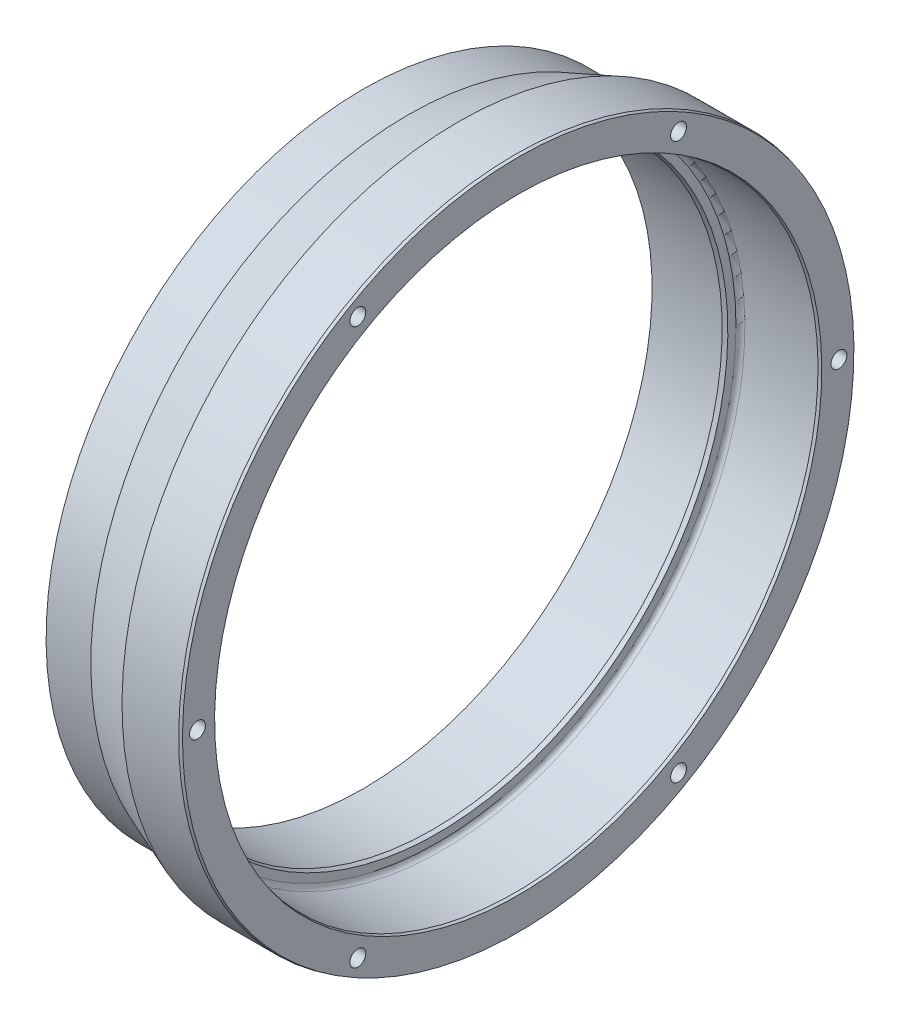
ISO-10303-21;
HEADER;
FILE_DESCRIPTION(('STEP AP214'),'2;1');
FILE_NAME('part.step','',(''),(''),'','','');
FILE_SCHEMA(('AUTOMOTIVE_DESIGN { 1 0 10303 214 1 1 1 1 }'));
ENDSEC;
DATA;
#1=APPLICATION_CONTEXT('core data for automotive mechanical design processes');
#2=APPLICATION_PROTOCOL_DEFINITION('international standard','automotive_design',2000,#1);
#3=PRODUCT_CONTEXT('',#1,'mechanical');
#4=PRODUCT('Part','Part','',(#3));
#5=PRODUCT_RELATED_PRODUCT_CATEGORY('part','',(#4));
#6=PRODUCT_DEFINITION_FORMATION('','',#4);
#7=PRODUCT_DEFINITION_CONTEXT('part definition',#1,'design');
#8=PRODUCT_DEFINITION('design','',#6,#7);
#9=PRODUCT_DEFINITION_SHAPE('','',#8);
#10=(LENGTH_UNIT() NAMED_UNIT(*) SI_UNIT(.MILLI.,.METRE.));
#11=(NAMED_UNIT(*) PLANE_ANGLE_UNIT() SI_UNIT($,.RADIAN.));
#12=(NAMED_UNIT(*) SI_UNIT($,.STERADIAN.) SOLID_ANGLE_UNIT());
#13=UNCERTAINTY_MEASURE_WITH_UNIT(LENGTH_MEASURE(1.E-05),#10,'distance_accuracy_value','');
#14=(GEOMETRIC_REPRESENTATION_CONTEXT(3) GLOBAL_UNCERTAINTY_ASSIGNED_CONTEXT((#13)) GLOBAL_UNIT_ASSIGNED_CONTEXT((#10,
#11,#12)) REPRESENTATION_CONTEXT('',''));
#15=CARTESIAN_POINT('',(0.,0.,0.));
#16=DIRECTION('',(0.,0.,1.));
#17=DIRECTION('',(1.,0.,0.));
#18=AXIS2_PLACEMENT_3D('',#15,#16,#17);
#19=CARTESIAN_POINT('',(0.,0.,0.));
#20=DIRECTION('',(1.,0.,0.));
#21=DIRECTION('',(0.,1.,0.));
#22=AXIS2_PLACEMENT_3D('',#19,#20,#21);
#23=CYLINDRICAL_SURFACE('',#22,57.3024);
#24=CARTESIAN_POINT('',(-10.16,0.,0.));
#25=DIRECTION('',(1.,0.,0.));
#26=DIRECTION('',(0.,1.,0.));
#27=AXIS2_PLACEMENT_3D('',#24,#25,#26);
#28=CIRCLE('',#27,57.3024);
#29=CARTESIAN_POINT('',(-10.16,57.3024,0.));
#30=VERTEX_POINT('',#29);
#31=EDGE_CURVE('E11',#30,#30,#28,.T.);
#32=ORIENTED_EDGE('',*,*,#31,.T.);
#33=EDGE_LOOP('',(#32));
#34=FACE_BOUND('',#33,.T.);
#35=CARTESIAN_POINT('',(-0.507999999999993,0.,0.));
#36=DIRECTION('',(1.,0.,0.));
#37=DIRECTION('',(0.,1.,0.));
#38=AXIS2_PLACEMENT_3D('',#35,#36,#37);
#39=CIRCLE('',#38,57.3024);
#40=CARTESIAN_POINT('',(-0.508,57.3024,0.));
#41=VERTEX_POINT('',#40);
#42=EDGE_CURVE('E109',#41,#41,#39,.T.);
#43=ORIENTED_EDGE('',*,*,#42,.F.);
#44=EDGE_LOOP('',(#43));
#45=FACE_BOUND('',#44,.T.);
#46=ADVANCED_FACE('F38',(#34,#45),#23,.T.);
#47=CARTESIAN_POINT('',(-10.16,0.,0.));
#48=DIRECTION('',(1.,0.,0.));
#49=DIRECTION('',(0.,1.,0.));
#50=AXIS2_PLACEMENT_3D('',#47,#48,#49);
#51=CONICAL_SURFACE('',#50,57.3024,0.367764966754291);
#52=CARTESIAN_POINT('',(-18.796,0.,0.));
#53=DIRECTION('',(1.,0.,0.));
#54=DIRECTION('',(0.,1.,0.));
#55=AXIS2_PLACEMENT_3D('',#52,#53,#54);
#56=CIRCLE('',#55,53.975);
#57=CARTESIAN_POINT('',(-18.796,53.975,0.));
#58=VERTEX_POINT('',#57);
#59=EDGE_CURVE('E45',#58,#58,#56,.T.);
#60=ORIENTED_EDGE('',*,*,#59,.T.);
#61=EDGE_LOOP('',(#60));
#62=FACE_BOUND('',#61,.T.);
#63=ORIENTED_EDGE('',*,*,#31,.F.);
#64=EDGE_LOOP('',(#63));
#65=FACE_BOUND('',#64,.T.);
#66=ADVANCED_FACE('F141',(#62,#65),#51,.T.);
#67=CARTESIAN_POINT('',(0.,0.,0.));
#68=DIRECTION('',(1.,0.,0.));
#69=DIRECTION('',(0.,1.,0.));
#70=AXIS2_PLACEMENT_3D('',#67,#68,#69);
#71=CYLINDRICAL_SURFACE('',#70,53.975);
#72=CARTESIAN_POINT('',(-26.416,0.,0.));
#73=DIRECTION('',(1.,0.,0.));
#74=DIRECTION('',(0.,1.,0.));
#75=AXIS2_PLACEMENT_3D('',#72,#73,#74);
#76=CIRCLE('',#75,53.975);
#77=CARTESIAN_POINT('',(-26.416,53.975,0.));
#78=VERTEX_POINT('',#77);
#79=EDGE_CURVE('E136',#78,#78,#76,.T.);
#80=ORIENTED_EDGE('',*,*,#79,.T.);
#81=EDGE_LOOP('',(#80));
#82=FACE_BOUND('',#81,.T.);
#83=ORIENTED_EDGE('',*,*,#59,.F.);
#84=EDGE_LOOP('',(#83));
#85=FACE_BOUND('',#84,.T.);
#86=ADVANCED_FACE('F144',(#82,#85),#71,.T.);
#87=CARTESIAN_POINT('',(-26.416,53.975,0.));
#88=DIRECTION('',(-1.,0.,0.));
#89=DIRECTION('',(0.,-1.,0.));
#90=AXIS2_PLACEMENT_3D('',#87,#88,#89);
#91=PLANE('',#90);
#92=CARTESIAN_POINT('',(-26.416,0.,0.));
#93=DIRECTION('',(1.,0.,0.));
#94=DIRECTION('',(0.,1.,0.));
#95=AXIS2_PLACEMENT_3D('',#92,#93,#94);
#96=CIRCLE('',#95,49.2125);
#97=CARTESIAN_POINT('',(-26.416,49.2125,0.));
#98=VERTEX_POINT('',#97);
#99=EDGE_CURVE('E133',#98,#98,#96,.T.);
#100=ORIENTED_EDGE('',*,*,#99,.T.);
#101=EDGE_LOOP('',(#100));
#102=FACE_BOUND('',#101,.T.);
#103=ORIENTED_EDGE('',*,*,#79,.F.);
#104=EDGE_LOOP('',(#103));
#105=FACE_BOUND('',#104,.T.);
#106=ADVANCED_FACE('F146',(#102,#105),#91,.T.);
#107=CARTESIAN_POINT('',(0.,0.,0.));
#108=DIRECTION('',(1.,0.,0.));
#109=DIRECTION('',(0.,1.,0.));
#110=AXIS2_PLACEMENT_3D('',#107,#108,#109);
#111=CYLINDRICAL_SURFACE('',#110,49.2125);
#112=CARTESIAN_POINT('',(-14.478,0.,0.));
#113=DIRECTION('',(1.,0.,0.));
#114=DIRECTION('',(0.,1.,0.));
#115=AXIS2_PLACEMENT_3D('',#112,#113,#114);
#116=CIRCLE('',#115,49.2125);
#117=CARTESIAN_POINT('',(-14.478,49.2125,0.));
#118=VERTEX_POINT('',#117);
#119=EDGE_CURVE('E130',#118,#118,#116,.T.);
#120=ORIENTED_EDGE('',*,*,#119,.T.);
#121=EDGE_LOOP('',(#120));
#122=FACE_BOUND('',#121,.T.);
#123=ORIENTED_EDGE('',*,*,#99,.F.);
#124=EDGE_LOOP('',(#123));
#125=FACE_BOUND('',#124,.T.);
#126=ADVANCED_FACE('F153',(#122,#125),#111,.F.);
#127=CARTESIAN_POINT('',(-14.478,0.,0.));
#128=DIRECTION('',(1.,0.,0.));
#129=DIRECTION('',(0.,1.,0.));
#130=AXIS2_PLACEMENT_3D('',#127,#128,#129);
#131=CONICAL_SURFACE('',#130,49.2125,0.261799387799153);
#132=CARTESIAN_POINT('',(-13.716,0.,0.));
#133=DIRECTION('',(1.,0.,0.));
#134=DIRECTION('',(0.,1.,0.));
#135=AXIS2_PLACEMENT_3D('',#132,#133,#134);
#136=CIRCLE('',#135,49.4166772846325);
#137=CARTESIAN_POINT('',(-13.716,49.4166772846325,0.));
#138=VERTEX_POINT('',#137);
#139=EDGE_CURVE('E127',#138,#138,#136,.T.);
#140=ORIENTED_EDGE('',*,*,#139,.T.);
#141=EDGE_LOOP('',(#140));
#142=FACE_BOUND('',#141,.T.);
#143=ORIENTED_EDGE('',*,*,#119,.F.);
#144=EDGE_LOOP('',(#143));
#145=FACE_BOUND('',#144,.T.);
#146=ADVANCED_FACE('F199',(#142,#145),#131,.F.);
#147=CARTESIAN_POINT('',(-13.716,49.4166772846325,0.));
#148=DIRECTION('',(1.,0.,0.));
#149=DIRECTION('',(0.,1.,0.));
#150=AXIS2_PLACEMENT_3D('',#147,#148,#149);
#151=PLANE('',#150);
#152=CARTESIAN_POINT('',(-13.716,0.,0.));
#153=DIRECTION('',(1.,0.,0.));
#154=DIRECTION('',(0.,1.,0.));
#155=AXIS2_PLACEMENT_3D('',#152,#153,#154);
#156=CIRCLE('',#155,50.8);
#157=CARTESIAN_POINT('',(-13.716,50.8,0.));
#158=VERTEX_POINT('',#157);
#159=EDGE_CURVE('E124',#158,#158,#156,.T.);
#160=ORIENTED_EDGE('',*,*,#159,.T.);
#161=EDGE_LOOP('',(#160));
#162=FACE_BOUND('',#161,.T.);
#163=ORIENTED_EDGE('',*,*,#139,.F.);
#164=EDGE_LOOP('',(#163));
#165=FACE_BOUND('',#164,.T.);
#166=ADVANCED_FACE('F193',(#162,#165),#151,.T.);
#167=CARTESIAN_POINT('',(-12.954,0.,0.));
#168=DIRECTION('',(1.,0.,0.));
#169=DIRECTION('',(0.,1.,0.));
#170=AXIS2_PLACEMENT_3D('',#167,#168,#169);
#171=TOROIDAL_SURFACE('',#170,50.8,0.762000000000002);
#172=CARTESIAN_POINT('',(-12.954,0.,0.));
#173=DIRECTION('',(1.,0.,0.));
#174=DIRECTION('',(0.,1.,0.));
#175=AXIS2_PLACEMENT_3D('',#172,#173,#174);
#176=CIRCLE('',#175,51.562);
#177=CARTESIAN_POINT('',(-12.954,51.562,0.));
#178=VERTEX_POINT('',#177);
#179=EDGE_CURVE('E121',#178,#178,#176,.T.);
#180=ORIENTED_EDGE('',*,*,#179,.T.);
#181=EDGE_LOOP('',(#180));
#182=FACE_BOUND('',#181,.T.);
#183=ORIENTED_EDGE('',*,*,#159,.F.);
#184=EDGE_LOOP('',(#183));
#185=FACE_BOUND('',#184,.T.);
#186=ADVANCED_FACE('F187',(#182,#185),#171,.F.);
#187=CARTESIAN_POINT('',(0.,0.,0.));
#188=DIRECTION('',(1.,0.,0.));
#189=DIRECTION('',(0.,1.,0.));
#190=AXIS2_PLACEMENT_3D('',#187,#188,#189);
#191=CYLINDRICAL_SURFACE('',#190,51.562);
#192=CARTESIAN_POINT('',(-0.507999999999993,0.,0.));
#193=DIRECTION('',(1.,0.,0.));
#194=DIRECTION('',(0.,1.,0.));
#195=AXIS2_PLACEMENT_3D('',#192,#193,#194);
#196=CIRCLE('',#195,51.562);
#197=CARTESIAN_POINT('',(-0.508,51.562,0.));
#198=VERTEX_POINT('',#197);
#199=EDGE_CURVE('E118',#198,#198,#196,.T.);
#200=ORIENTED_EDGE('',*,*,#199,.T.);
#201=EDGE_LOOP('',(#200));
#202=FACE_BOUND('',#201,.T.);
#203=ORIENTED_EDGE('',*,*,#179,.F.);
#204=EDGE_LOOP('',(#203));
#205=FACE_BOUND('',#204,.T.);
#206=ADVANCED_FACE('F181',(#202,#205),#191,.F.);
#207=CARTESIAN_POINT('',(-0.507999999999993,0.,0.));
#208=DIRECTION('',(1.,0.,0.));
#209=DIRECTION('',(0.,1.,0.));
#210=AXIS2_PLACEMENT_3D('',#207,#208,#209);
#211=CONICAL_SURFACE('',#210,51.562,0.261799387799145);
#212=CARTESIAN_POINT('',(0.,0.,0.));
#213=DIRECTION('',(1.,0.,0.));
#214=DIRECTION('',(0.,1.,0.));
#215=AXIS2_PLACEMENT_3D('',#212,#213,#214);
#216=CIRCLE('',#215,51.698118189755);
#217=CARTESIAN_POINT('',(0.,51.698118189755,0.));
#218=VERTEX_POINT('',#217);
#219=EDGE_CURVE('E115',#218,#218,#216,.T.);
#220=ORIENTED_EDGE('',*,*,#219,.T.);
#221=EDGE_LOOP('',(#220));
#222=FACE_BOUND('',#221,.T.);
#223=ORIENTED_EDGE('',*,*,#199,.F.);
#224=EDGE_LOOP('',(#223));
#225=FACE_BOUND('',#224,.T.);
#226=ADVANCED_FACE('F174',(#222,#225),#211,.F.);
#227=CARTESIAN_POINT('',(0.,51.698118189755,0.));
#228=DIRECTION('',(1.,0.,0.));
#229=DIRECTION('',(0.,1.,0.));
#230=AXIS2_PLACEMENT_3D('',#227,#228,#229);
#231=PLANE('',#230);
#232=CARTESIAN_POINT('',(0.,47.2936473006679,27.3050000000006));
#233=DIRECTION('',(1.,0.,0.));
#234=DIRECTION('',(0.,0.,-1.));
#235=AXIS2_PLACEMENT_3D('',#232,#233,#234);
#236=CIRCLE('',#235,1.35254999999999);
#237=CARTESIAN_POINT('',(0.,47.2936473006679,25.9524500000006));
#238=VERTEX_POINT('',#237);
#239=EDGE_CURVE('E75',#238,#238,#236,.T.);
#240=ORIENTED_EDGE('',*,*,#239,.F.);
#241=EDGE_LOOP('',(#240));
#242=FACE_BOUND('',#241,.T.);
#243=CARTESIAN_POINT('',(0.,47.2936473006684,-27.3049999999996));
#244=DIRECTION('',(1.,0.,0.));
#245=DIRECTION('',(0.,0.,-1.));
#246=AXIS2_PLACEMENT_3D('',#243,#244,#245);
#247=CIRCLE('',#246,1.35254999999999);
#248=CARTESIAN_POINT('',(0.,47.2936473006684,-28.6575499999995));
#249=VERTEX_POINT('',#248);
#250=EDGE_CURVE('E74',#249,#249,#247,.T.);
#251=ORIENTED_EDGE('',*,*,#250,.F.);
#252=EDGE_LOOP('',(#251));
#253=FACE_BOUND('',#252,.T.);
#254=CARTESIAN_POINT('',(0.,0.,-54.61));
#255=DIRECTION('',(1.,0.,0.));
#256=DIRECTION('',(0.,0.,-1.));
#257=AXIS2_PLACEMENT_3D('',#254,#255,#256);
#258=CIRCLE('',#257,1.35254999999999);
#259=CARTESIAN_POINT('',(0.,0.,-55.96255));
#260=VERTEX_POINT('',#259);
#261=EDGE_CURVE('E85',#260,#260,#258,.T.);
#262=ORIENTED_EDGE('',*,*,#261,.F.);
#263=EDGE_LOOP('',(#262));
#264=FACE_BOUND('',#263,.T.);
#265=CARTESIAN_POINT('',(0.,-47.2936473006681,-27.3050000000002));
#266=DIRECTION('',(1.,0.,0.));
#267=DIRECTION('',(0.,0.,-1.));
#268=AXIS2_PLACEMENT_3D('',#265,#266,#267);
#269=CIRCLE('',#268,1.35254999999999);
#270=CARTESIAN_POINT('',(0.,-47.2936473006681,-28.6575500000002));
#271=VERTEX_POINT('',#270);
#272=EDGE_CURVE('E91',#271,#271,#269,.T.);
#273=ORIENTED_EDGE('',*,*,#272,.F.);
#274=EDGE_LOOP('',(#273));
#275=FACE_BOUND('',#274,.T.);
#276=CARTESIAN_POINT('',(0.,-47.2936473006683,27.3049999999999));
#277=DIRECTION('',(1.,0.,0.));
#278=DIRECTION('',(0.,0.,-1.));
#279=AXIS2_PLACEMENT_3D('',#276,#277,#278);
#280=CIRCLE('',#279,1.35254999999999);
#281=CARTESIAN_POINT('',(0.,-47.2936473006683,25.9524499999999));
#282=VERTEX_POINT('',#281);
#283=EDGE_CURVE('E97',#282,#282,#280,.T.);
#284=ORIENTED_EDGE('',*,*,#283,.F.);
#285=EDGE_LOOP('',(#284));
#286=FACE_BOUND('',#285,.T.);
#287=CARTESIAN_POINT('',(0.,0.,54.61));
#288=DIRECTION('',(1.,0.,0.));
#289=DIRECTION('',(0.,0.,-1.));
#290=AXIS2_PLACEMENT_3D('',#287,#288,#289);
#291=CIRCLE('',#290,1.35254999999999);
#292=CARTESIAN_POINT('',(0.,0.,53.25745));
#293=VERTEX_POINT('',#292);
#294=EDGE_CURVE('E103',#293,#293,#291,.T.);
#295=ORIENTED_EDGE('',*,*,#294,.F.);
#296=EDGE_LOOP('',(#295));
#297=FACE_BOUND('',#296,.T.);
#298=CARTESIAN_POINT('',(0.,0.,0.));
#299=DIRECTION('',(1.,0.,0.));
#300=DIRECTION('',(0.,1.,0.));
#301=AXIS2_PLACEMENT_3D('',#298,#299,#300);
#302=CIRCLE('',#301,57.166281810245);
#303=CARTESIAN_POINT('',(0.,57.166281810245,0.));
#304=VERTEX_POINT('',#303);
#305=EDGE_CURVE('E112',#304,#304,#302,.T.);
#306=ORIENTED_EDGE('',*,*,#305,.T.);
#307=EDGE_LOOP('',(#306));
#308=FACE_BOUND('',#307,.T.);
#309=ORIENTED_EDGE('',*,*,#219,.F.);
#310=EDGE_LOOP('',(#309));
#311=FACE_BOUND('',#310,.T.);
#312=ADVANCED_FACE('F168',(#242,#253,#264,#275,#286,#297,#308,#311),#231,.T.);
#313=CARTESIAN_POINT('',(0.,0.,0.));
#314=DIRECTION('',(-1.,0.,0.));
#315=DIRECTION('',(0.,-1.,0.));
#316=AXIS2_PLACEMENT_3D('',#313,#314,#315);
#317=CONICAL_SURFACE('',#316,57.166281810245,0.261799387799145);
#318=ORIENTED_EDGE('',*,*,#42,.T.);
#319=EDGE_LOOP('',(#318));
#320=FACE_BOUND('',#319,.T.);
#321=ORIENTED_EDGE('',*,*,#305,.F.);
#322=EDGE_LOOP('',(#321));
#323=FACE_BOUND('',#322,.T.);
#324=ADVANCED_FACE('F164',(#320,#323),#317,.T.);
#325=CARTESIAN_POINT('',(-8.89,0.,54.61));
#326=DIRECTION('',(1.,0.,0.));
#327=DIRECTION('',(0.,0.,-1.));
#328=AXIS2_PLACEMENT_3D('',#325,#326,#327);
#329=CONICAL_SURFACE('',#328,1.35255,1.02974425867665);
#330=CARTESIAN_POINT('',(-9.70269403026573,0.,54.61));
#331=VERTEX_POINT('',#330);
#332=VERTEX_LOOP('',#331);
#333=FACE_BOUND('',#332,.T.);
#334=CARTESIAN_POINT('',(-8.89,0.,54.61));
#335=DIRECTION('',(1.,0.,0.));
#336=DIRECTION('',(0.,0.,-1.));
#337=AXIS2_PLACEMENT_3D('',#334,#335,#336);
#338=CIRCLE('',#337,1.35255);
#339=CARTESIAN_POINT('',(-8.89,0.,53.25745));
#340=VERTEX_POINT('',#339);
#341=EDGE_CURVE('E106',#340,#340,#338,.T.);
#342=ORIENTED_EDGE('',*,*,#341,.T.);
#343=EDGE_LOOP('',(#342));
#344=FACE_BOUND('',#343,.T.);
#345=ADVANCED_FACE('F167',(#333,#344),#329,.F.);
#346=CARTESIAN_POINT('',(0.,0.,54.61));
#347=DIRECTION('',(1.,0.,0.));
#348=DIRECTION('',(0.,0.,-1.));
#349=AXIS2_PLACEMENT_3D('',#346,#347,#348);
#350=CYLINDRICAL_SURFACE('',#349,1.35254999999999);
#351=ORIENTED_EDGE('',*,*,#341,.F.);
#352=EDGE_LOOP('',(#351));
#353=FACE_BOUND('',#352,.T.);
#354=ORIENTED_EDGE('',*,*,#294,.T.);
#355=EDGE_LOOP('',(#354));
#356=FACE_BOUND('',#355,.T.);
#357=ADVANCED_FACE('F219',(#353,#356),#350,.F.);
#358=CARTESIAN_POINT('',(-8.88999999999999,-47.2936473006683,27.3049999999999));
#359=DIRECTION('',(1.,0.,0.));
#360=DIRECTION('',(0.,0.,-1.));
#361=AXIS2_PLACEMENT_3D('',#358,#359,#360);
#362=CONICAL_SURFACE('',#361,1.35255,1.02974425867665);
#363=CARTESIAN_POINT('',(-9.70269403026572,-47.2936473006683,27.3049999999999));
#364=VERTEX_POINT('',#363);
#365=VERTEX_LOOP('',#364);
#366=FACE_BOUND('',#365,.T.);
#367=CARTESIAN_POINT('',(-8.88999999999999,-47.2936473006683,27.3049999999999));
#368=DIRECTION('',(1.,0.,0.));
#369=DIRECTION('',(0.,0.,-1.));
#370=AXIS2_PLACEMENT_3D('',#367,#368,#369);
#371=CIRCLE('',#370,1.35255);
#372=CARTESIAN_POINT('',(-8.88999999999999,-47.2936473006683,25.9524499999999));
#373=VERTEX_POINT('',#372);
#374=EDGE_CURVE('E100',#373,#373,#371,.T.);
#375=ORIENTED_EDGE('',*,*,#374,.T.);
#376=EDGE_LOOP('',(#375));
#377=FACE_BOUND('',#376,.T.);
#378=ADVANCED_FACE('F222',(#366,#377),#362,.F.);
#379=CARTESIAN_POINT('',(0.,-47.2936473006683,27.3049999999999));
#380=DIRECTION('',(1.,0.,0.));
#381=DIRECTION('',(0.,0.,-1.));
#382=AXIS2_PLACEMENT_3D('',#379,#380,#381);
#383=CYLINDRICAL_SURFACE('',#382,1.35254999999999);
#384=ORIENTED_EDGE('',*,*,#374,.F.);
#385=EDGE_LOOP('',(#384));
#386=FACE_BOUND('',#385,.T.);
#387=ORIENTED_EDGE('',*,*,#283,.T.);
#388=EDGE_LOOP('',(#387));
#389=FACE_BOUND('',#388,.T.);
#390=ADVANCED_FACE('F226',(#386,#389),#383,.F.);
#391=CARTESIAN_POINT('',(-8.88999999999999,-47.2936473006681,-27.3050000000002));
#392=DIRECTION('',(1.,0.,0.));
#393=DIRECTION('',(0.,0.,-1.));
#394=AXIS2_PLACEMENT_3D('',#391,#392,#393);
#395=CONICAL_SURFACE('',#394,1.35255,1.02974425867665);
#396=CARTESIAN_POINT('',(-9.70269403026572,-47.2936473006681,-27.3050000000002));
#397=VERTEX_POINT('',#396);
#398=VERTEX_LOOP('',#397);
#399=FACE_BOUND('',#398,.T.);
#400=CARTESIAN_POINT('',(-8.88999999999999,-47.2936473006681,-27.3050000000002));
#401=DIRECTION('',(1.,0.,0.));
#402=DIRECTION('',(0.,0.,-1.));
#403=AXIS2_PLACEMENT_3D('',#400,#401,#402);
#404=CIRCLE('',#403,1.35255);
#405=CARTESIAN_POINT('',(-8.88999999999999,-47.2936473006681,-28.6575500000002));
#406=VERTEX_POINT('',#405);
#407=EDGE_CURVE('E94',#406,#406,#404,.T.);
#408=ORIENTED_EDGE('',*,*,#407,.T.);
#409=EDGE_LOOP('',(#408));
#410=FACE_BOUND('',#409,.T.);
#411=ADVANCED_FACE('F229',(#399,#410),#395,.F.);
#412=CARTESIAN_POINT('',(0.,-47.2936473006681,-27.3050000000002));
#413=DIRECTION('',(1.,0.,0.));
#414=DIRECTION('',(0.,0.,-1.));
#415=AXIS2_PLACEMENT_3D('',#412,#413,#414);
#416=CYLINDRICAL_SURFACE('',#415,1.35254999999999);
#417=ORIENTED_EDGE('',*,*,#407,.F.);
#418=EDGE_LOOP('',(#417));
#419=FACE_BOUND('',#418,.T.);
#420=ORIENTED_EDGE('',*,*,#272,.T.);
#421=EDGE_LOOP('',(#420));
#422=FACE_BOUND('',#421,.T.);
#423=ADVANCED_FACE('F233',(#419,#422),#416,.F.);
#424=CARTESIAN_POINT('',(-8.89,0.,-54.61));
#425=DIRECTION('',(1.,0.,0.));
#426=DIRECTION('',(0.,0.,-1.));
#427=AXIS2_PLACEMENT_3D('',#424,#425,#426);
#428=CONICAL_SURFACE('',#427,1.35255,1.02974425867665);
#429=CARTESIAN_POINT('',(-9.70269403026573,0.,-54.61));
#430=VERTEX_POINT('',#429);
#431=VERTEX_LOOP('',#430);
#432=FACE_BOUND('',#431,.T.);
#433=CARTESIAN_POINT('',(-8.89,0.,-54.61));
#434=DIRECTION('',(1.,0.,0.));
#435=DIRECTION('',(0.,0.,-1.));
#436=AXIS2_PLACEMENT_3D('',#433,#434,#435);
#437=CIRCLE('',#436,1.35255);
#438=CARTESIAN_POINT('',(-8.89,0.,-55.96255));
#439=VERTEX_POINT('',#438);
#440=EDGE_CURVE('E88',#439,#439,#437,.T.);
#441=ORIENTED_EDGE('',*,*,#440,.T.);
#442=EDGE_LOOP('',(#441));
#443=FACE_BOUND('',#442,.T.);
#444=ADVANCED_FACE('F237',(#432,#443),#428,.F.);
#445=CARTESIAN_POINT('',(0.,0.,-54.61));
#446=DIRECTION('',(1.,0.,0.));
#447=DIRECTION('',(0.,0.,-1.));
#448=AXIS2_PLACEMENT_3D('',#445,#446,#447);
#449=CYLINDRICAL_SURFACE('',#448,1.35254999999999);
#450=ORIENTED_EDGE('',*,*,#440,.F.);
#451=EDGE_LOOP('',(#450));
#452=FACE_BOUND('',#451,.T.);
#453=ORIENTED_EDGE('',*,*,#261,.T.);
#454=EDGE_LOOP('',(#453));
#455=FACE_BOUND('',#454,.T.);
#456=ADVANCED_FACE('F241',(#452,#455),#449,.F.);
#457=CARTESIAN_POINT('',(-8.89,47.2936473006684,-27.3049999999996));
#458=DIRECTION('',(1.,0.,0.));
#459=DIRECTION('',(0.,0.,-1.));
#460=AXIS2_PLACEMENT_3D('',#457,#458,#459);
#461=CONICAL_SURFACE('',#460,1.35255,1.02974425867665);
#462=CARTESIAN_POINT('',(-9.70269403026573,47.2936473006684,-27.3049999999996));
#463=VERTEX_POINT('',#462);
#464=VERTEX_LOOP('',#463);
#465=FACE_BOUND('',#464,.T.);
#466=CARTESIAN_POINT('',(-8.89,47.2936473006684,-27.3049999999996));
#467=DIRECTION('',(1.,0.,0.));
#468=DIRECTION('',(0.,0.,-1.));
#469=AXIS2_PLACEMENT_3D('',#466,#467,#468);
#470=CIRCLE('',#469,1.35255);
#471=CARTESIAN_POINT('',(-8.89,47.2936473006684,-28.6575499999996));
#472=VERTEX_POINT('',#471);
#473=EDGE_CURVE('E78',#472,#472,#470,.T.);
#474=ORIENTED_EDGE('',*,*,#473,.T.);
#475=EDGE_LOOP('',(#474));
#476=FACE_BOUND('',#475,.T.);
#477=ADVANCED_FACE('F245',(#465,#476),#461,.F.);
#478=CARTESIAN_POINT('',(0.,47.2936473006684,-27.3049999999996));
#479=DIRECTION('',(1.,0.,0.));
#480=DIRECTION('',(0.,0.,-1.));
#481=AXIS2_PLACEMENT_3D('',#478,#479,#480);
#482=CYLINDRICAL_SURFACE('',#481,1.35254999999999);
#483=ORIENTED_EDGE('',*,*,#473,.F.);
#484=EDGE_LOOP('',(#483));
#485=FACE_BOUND('',#484,.T.);
#486=ORIENTED_EDGE('',*,*,#250,.T.);
#487=EDGE_LOOP('',(#486));
#488=FACE_BOUND('',#487,.T.);
#489=ADVANCED_FACE('F68',(#485,#488),#482,.F.);
#490=CARTESIAN_POINT('',(-8.89,47.2936473006679,27.3050000000006));
#491=DIRECTION('',(1.,0.,0.));
#492=DIRECTION('',(0.,0.,-1.));
#493=AXIS2_PLACEMENT_3D('',#490,#491,#492);
#494=CONICAL_SURFACE('',#493,1.35255,1.02974425867665);
#495=CARTESIAN_POINT('',(-9.70269403026573,47.2936473006679,27.3050000000006));
#496=VERTEX_POINT('',#495);
#497=VERTEX_LOOP('',#496);
#498=FACE_BOUND('',#497,.T.);
#499=CARTESIAN_POINT('',(-8.89,47.2936473006679,27.3050000000006));
#500=DIRECTION('',(1.,0.,0.));
#501=DIRECTION('',(0.,0.,-1.));
#502=AXIS2_PLACEMENT_3D('',#499,#500,#501);
#503=CIRCLE('',#502,1.35255);
#504=CARTESIAN_POINT('',(-8.89,47.2936473006679,25.9524500000005));
#505=VERTEX_POINT('',#504);
#506=EDGE_CURVE('E72',#505,#505,#503,.T.);
#507=ORIENTED_EDGE('',*,*,#506,.T.);
#508=EDGE_LOOP('',(#507));
#509=FACE_BOUND('',#508,.T.);
#510=ADVANCED_FACE('F64',(#498,#509),#494,.F.);
#511=CARTESIAN_POINT('',(0.,47.2936473006679,27.3050000000006));
#512=DIRECTION('',(1.,0.,0.));
#513=DIRECTION('',(0.,0.,-1.));
#514=AXIS2_PLACEMENT_3D('',#511,#512,#513);
#515=CYLINDRICAL_SURFACE('',#514,1.35254999999999);
#516=ORIENTED_EDGE('',*,*,#506,.F.);
#517=EDGE_LOOP('',(#516));
#518=FACE_BOUND('',#517,.T.);
#519=ORIENTED_EDGE('',*,*,#239,.T.);
#520=EDGE_LOOP('',(#519));
#521=FACE_BOUND('',#520,.T.);
#522=ADVANCED_FACE('F67',(#518,#521),#515,.F.);
#523=CLOSED_SHELL('',(#46,#66,#86,#106,#126,#146,#166,#186,#206,#226,#312,#324,#345,#357,#378,
#390,#411,#423,#444,#456,#477,#489,#510,#522));
#524=MANIFOLD_SOLID_BREP('B2',#523);
#525=ADVANCED_BREP_SHAPE_REPRESENTATION('',(#18,#524),#14);
#526=SHAPE_DEFINITION_REPRESENTATION(#9,#525);
ENDSEC;
END-ISO-10303-21;
